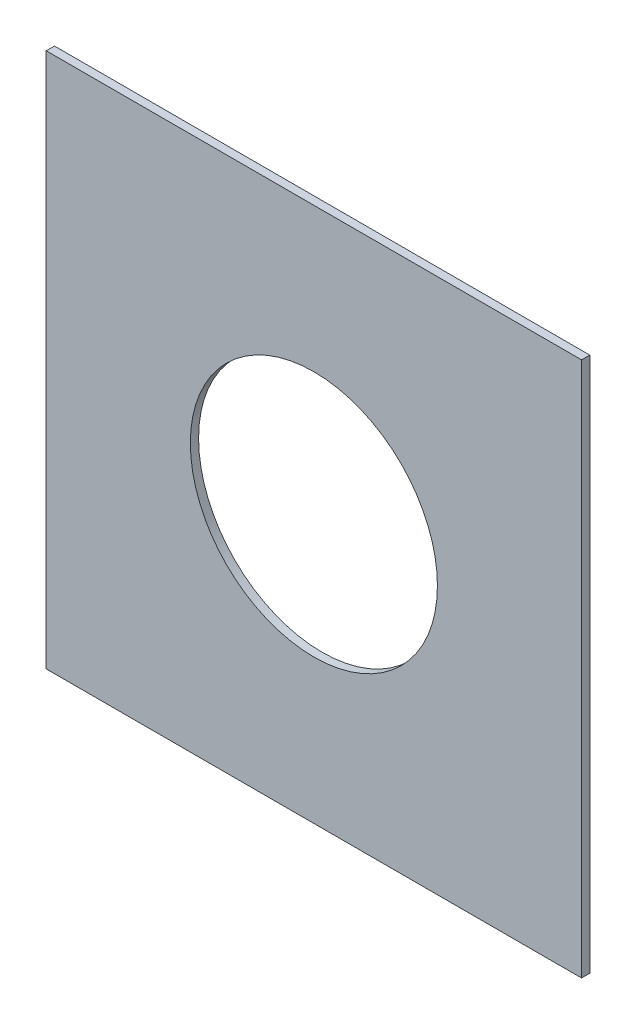
ISO-10303-21;
HEADER;
FILE_DESCRIPTION(('STEP AP214'),'2;1');
FILE_NAME('part.step','',(''),(''),'','','');
FILE_SCHEMA(('AUTOMOTIVE_DESIGN { 1 0 10303 214 1 1 1 1 }'));
ENDSEC;
DATA;
#1=APPLICATION_CONTEXT('core data for automotive mechanical design processes');
#2=APPLICATION_PROTOCOL_DEFINITION('international standard','automotive_design',2000,#1);
#3=PRODUCT_CONTEXT('',#1,'mechanical');
#4=PRODUCT('Part','Part','',(#3));
#5=PRODUCT_RELATED_PRODUCT_CATEGORY('part','',(#4));
#6=PRODUCT_DEFINITION_FORMATION('','',#4);
#7=PRODUCT_DEFINITION_CONTEXT('part definition',#1,'design');
#8=PRODUCT_DEFINITION('design','',#6,#7);
#9=PRODUCT_DEFINITION_SHAPE('','',#8);
#10=(LENGTH_UNIT() NAMED_UNIT(*) SI_UNIT(.MILLI.,.METRE.));
#11=(NAMED_UNIT(*) PLANE_ANGLE_UNIT() SI_UNIT($,.RADIAN.));
#12=(NAMED_UNIT(*) SI_UNIT($,.STERADIAN.) SOLID_ANGLE_UNIT());
#13=UNCERTAINTY_MEASURE_WITH_UNIT(LENGTH_MEASURE(1.E-05),#10,'distance_accuracy_value','');
#14=(GEOMETRIC_REPRESENTATION_CONTEXT(3) GLOBAL_UNCERTAINTY_ASSIGNED_CONTEXT((#13)) GLOBAL_UNIT_ASSIGNED_CONTEXT((#10,
#11,#12)) REPRESENTATION_CONTEXT('',''));
#15=CARTESIAN_POINT('',(0.,0.,0.));
#16=DIRECTION('',(0.,0.,1.));
#17=DIRECTION('',(1.,0.,0.));
#18=AXIS2_PLACEMENT_3D('',#15,#16,#17);
#19=CARTESIAN_POINT('',(5.474,4.85,-6.999));
#20=DIRECTION('',(0.,1.,0.));
#21=DIRECTION('',(1.,0.,0.));
#22=AXIS2_PLACEMENT_3D('',#19,#20,#21);
#23=PLANE('',#22);
#24=DIRECTION('',(0.,0.,1.));
#25=VECTOR('',#24,1.);
#26=CARTESIAN_POINT('',(6.775,4.85,-7.01));
#27=LINE('',#26,#25);
#28=CARTESIAN_POINT('',(6.775,4.85,-7.02));
#29=VERTEX_POINT('',#28);
#30=CARTESIAN_POINT('',(6.775,4.85,-7.));
#31=VERTEX_POINT('',#30);
#32=EDGE_CURVE('E62',#29,#31,#27,.T.);
#33=ORIENTED_EDGE('',*,*,#32,.F.);
#34=DIRECTION('',(1.,0.,0.));
#35=VECTOR('',#34,1.);
#36=CARTESIAN_POINT('',(6.125,4.85,-7.02));
#37=LINE('',#36,#35);
#38=CARTESIAN_POINT('',(5.475,4.85,-7.02));
#39=VERTEX_POINT('',#38);
#40=EDGE_CURVE('E87',#39,#29,#37,.T.);
#41=ORIENTED_EDGE('',*,*,#40,.F.);
#42=DIRECTION('',(0.,0.,-1.));
#43=VECTOR('',#42,1.);
#44=CARTESIAN_POINT('',(5.475,4.85,-7.01));
#45=LINE('',#44,#43);
#46=CARTESIAN_POINT('',(5.475,4.85,-7.));
#47=VERTEX_POINT('',#46);
#48=EDGE_CURVE('E73',#47,#39,#45,.T.);
#49=ORIENTED_EDGE('',*,*,#48,.F.);
#50=DIRECTION('',(-1.,0.,0.));
#51=VECTOR('',#50,1.);
#52=CARTESIAN_POINT('',(6.125,4.85,-7.));
#53=LINE('',#52,#51);
#54=EDGE_CURVE('E56',#31,#47,#53,.T.);
#55=ORIENTED_EDGE('',*,*,#54,.F.);
#56=EDGE_LOOP('',(#33,#41,#49,#55));
#57=FACE_BOUND('',#56,.T.);
#58=ADVANCED_FACE('F17',(#57),#23,.T.);
#59=CARTESIAN_POINT('',(6.775,4.851,-6.999));
#60=DIRECTION('',(1.,0.,0.));
#61=DIRECTION('',(0.,-1.,0.));
#62=AXIS2_PLACEMENT_3D('',#59,#60,#61);
#63=PLANE('',#62);
#64=DIRECTION('',(0.,0.,-1.));
#65=VECTOR('',#64,1.);
#66=CARTESIAN_POINT('',(6.775,3.55,-7.01));
#67=LINE('',#66,#65);
#68=CARTESIAN_POINT('',(6.775,3.55,-7.));
#69=VERTEX_POINT('',#68);
#70=CARTESIAN_POINT('',(6.775,3.55,-7.02));
#71=VERTEX_POINT('',#70);
#72=EDGE_CURVE('E71',#69,#71,#67,.T.);
#73=ORIENTED_EDGE('',*,*,#72,.T.);
#74=DIRECTION('',(0.,-1.,0.));
#75=VECTOR('',#74,1.);
#76=CARTESIAN_POINT('',(6.775,4.2,-7.02));
#77=LINE('',#76,#75);
#78=EDGE_CURVE('E67',#29,#71,#77,.T.);
#79=ORIENTED_EDGE('',*,*,#78,.F.);
#80=ORIENTED_EDGE('',*,*,#32,.T.);
#81=DIRECTION('',(0.,1.,0.));
#82=VECTOR('',#81,1.);
#83=CARTESIAN_POINT('',(6.775,4.2,-7.));
#84=LINE('',#83,#82);
#85=EDGE_CURVE('E64',#69,#31,#84,.T.);
#86=ORIENTED_EDGE('',*,*,#85,.F.);
#87=EDGE_LOOP('',(#73,#79,#80,#86));
#88=FACE_BOUND('',#87,.T.);
#89=ADVANCED_FACE('F63',(#88),#63,.T.);
#90=CARTESIAN_POINT('',(6.125,4.2,-7.));
#91=DIRECTION('',(0.,0.,-1.));
#92=DIRECTION('',(-1.,0.,0.));
#93=AXIS2_PLACEMENT_3D('',#90,#91,#92);
#94=CYLINDRICAL_SURFACE('',#93,0.3);
#95=CARTESIAN_POINT('',(6.125,4.2,-7.02));
#96=DIRECTION('',(0.,0.,-1.));
#97=DIRECTION('',(-1.,0.,0.));
#98=AXIS2_PLACEMENT_3D('',#95,#96,#97);
#99=CIRCLE('',#98,0.3);
#100=CARTESIAN_POINT('',(5.825,4.2,-7.02));
#101=VERTEX_POINT('',#100);
#102=EDGE_CURVE('E82',#101,#101,#99,.F.);
#103=ORIENTED_EDGE('',*,*,#102,.F.);
#104=EDGE_LOOP('',(#103));
#105=FACE_BOUND('',#104,.T.);
#106=CARTESIAN_POINT('',(6.125,4.2,-7.));
#107=DIRECTION('',(0.,0.,-1.));
#108=DIRECTION('',(-1.,0.,0.));
#109=AXIS2_PLACEMENT_3D('',#106,#107,#108);
#110=CIRCLE('',#109,0.3);
#111=CARTESIAN_POINT('',(5.825,4.2,-7.));
#112=VERTEX_POINT('',#111);
#113=EDGE_CURVE('E21',#112,#112,#110,.T.);
#114=ORIENTED_EDGE('',*,*,#113,.F.);
#115=EDGE_LOOP('',(#114));
#116=FACE_BOUND('',#115,.T.);
#117=ADVANCED_FACE('F99',(#105,#116),#94,.F.);
#118=CARTESIAN_POINT('',(6.776,4.851,-7.));
#119=DIRECTION('',(0.,0.,1.));
#120=DIRECTION('',(-1.,0.,0.));
#121=AXIS2_PLACEMENT_3D('',#118,#119,#120);
#122=PLANE('',#121);
#123=ORIENTED_EDGE('',*,*,#113,.T.);
#124=EDGE_LOOP('',(#123));
#125=FACE_BOUND('',#124,.T.);
#126=DIRECTION('',(0.,1.,0.));
#127=VECTOR('',#126,1.);
#128=CARTESIAN_POINT('',(5.475,4.2,-7.));
#129=LINE('',#128,#127);
#130=CARTESIAN_POINT('',(5.475,3.55,-7.));
#131=VERTEX_POINT('',#130);
#132=EDGE_CURVE('E94',#131,#47,#129,.T.);
#133=ORIENTED_EDGE('',*,*,#132,.F.);
#134=DIRECTION('',(-1.,0.,0.));
#135=VECTOR('',#134,1.);
#136=CARTESIAN_POINT('',(6.125,3.55,-7.));
#137=LINE('',#136,#135);
#138=EDGE_CURVE('E78',#69,#131,#137,.T.);
#139=ORIENTED_EDGE('',*,*,#138,.F.);
#140=ORIENTED_EDGE('',*,*,#85,.T.);
#141=ORIENTED_EDGE('',*,*,#54,.T.);
#142=EDGE_LOOP('',(#133,#139,#140,#141));
#143=FACE_BOUND('',#142,.T.);
#144=ADVANCED_FACE('F76',(#125,#143),#122,.T.);
#145=CARTESIAN_POINT('',(5.475,3.549,-6.999));
#146=DIRECTION('',(-1.,0.,0.));
#147=DIRECTION('',(0.,1.,0.));
#148=AXIS2_PLACEMENT_3D('',#145,#146,#147);
#149=PLANE('',#148);
#150=ORIENTED_EDGE('',*,*,#48,.T.);
#151=DIRECTION('',(0.,1.,0.));
#152=VECTOR('',#151,1.);
#153=CARTESIAN_POINT('',(5.475,4.2,-7.02));
#154=LINE('',#153,#152);
#155=CARTESIAN_POINT('',(5.475,3.55,-7.02));
#156=VERTEX_POINT('',#155);
#157=EDGE_CURVE('E36',#156,#39,#154,.T.);
#158=ORIENTED_EDGE('',*,*,#157,.F.);
#159=DIRECTION('',(0.,0.,-1.));
#160=VECTOR('',#159,1.);
#161=CARTESIAN_POINT('',(5.475,3.55,-7.01));
#162=LINE('',#161,#160);
#163=EDGE_CURVE('E27',#131,#156,#162,.T.);
#164=ORIENTED_EDGE('',*,*,#163,.F.);
#165=ORIENTED_EDGE('',*,*,#132,.T.);
#166=EDGE_LOOP('',(#150,#158,#164,#165));
#167=FACE_BOUND('',#166,.T.);
#168=ADVANCED_FACE('F108',(#167),#149,.T.);
#169=CARTESIAN_POINT('',(5.474,4.851,-7.02));
#170=DIRECTION('',(0.,0.,-1.));
#171=DIRECTION('',(1.,0.,0.));
#172=AXIS2_PLACEMENT_3D('',#169,#170,#171);
#173=PLANE('',#172);
#174=ORIENTED_EDGE('',*,*,#102,.T.);
#175=EDGE_LOOP('',(#174));
#176=FACE_BOUND('',#175,.T.);
#177=ORIENTED_EDGE('',*,*,#40,.T.);
#178=ORIENTED_EDGE('',*,*,#78,.T.);
#179=DIRECTION('',(1.,0.,0.));
#180=VECTOR('',#179,1.);
#181=CARTESIAN_POINT('',(6.125,3.55,-7.02));
#182=LINE('',#181,#180);
#183=EDGE_CURVE('E11',#156,#71,#182,.T.);
#184=ORIENTED_EDGE('',*,*,#183,.F.);
#185=ORIENTED_EDGE('',*,*,#157,.T.);
#186=EDGE_LOOP('',(#177,#178,#184,#185));
#187=FACE_BOUND('',#186,.T.);
#188=ADVANCED_FACE('F112',(#176,#187),#173,.T.);
#189=CARTESIAN_POINT('',(6.776,3.55,-6.999));
#190=DIRECTION('',(0.,-1.,0.));
#191=DIRECTION('',(-1.,0.,0.));
#192=AXIS2_PLACEMENT_3D('',#189,#190,#191);
#193=PLANE('',#192);
#194=ORIENTED_EDGE('',*,*,#163,.T.);
#195=ORIENTED_EDGE('',*,*,#183,.T.);
#196=ORIENTED_EDGE('',*,*,#72,.F.);
#197=ORIENTED_EDGE('',*,*,#138,.T.);
#198=EDGE_LOOP('',(#194,#195,#196,#197));
#199=FACE_BOUND('',#198,.T.);
#200=ADVANCED_FACE('F19',(#199),#193,.T.);
#201=CLOSED_SHELL('',(#58,#89,#117,#144,#168,#188,#200));
#202=MANIFOLD_SOLID_BREP('B1',#201);
#203=ADVANCED_BREP_SHAPE_REPRESENTATION('',(#18,#202),#14);
#204=SHAPE_DEFINITION_REPRESENTATION(#9,#203);
ENDSEC;
END-ISO-10303-21;
